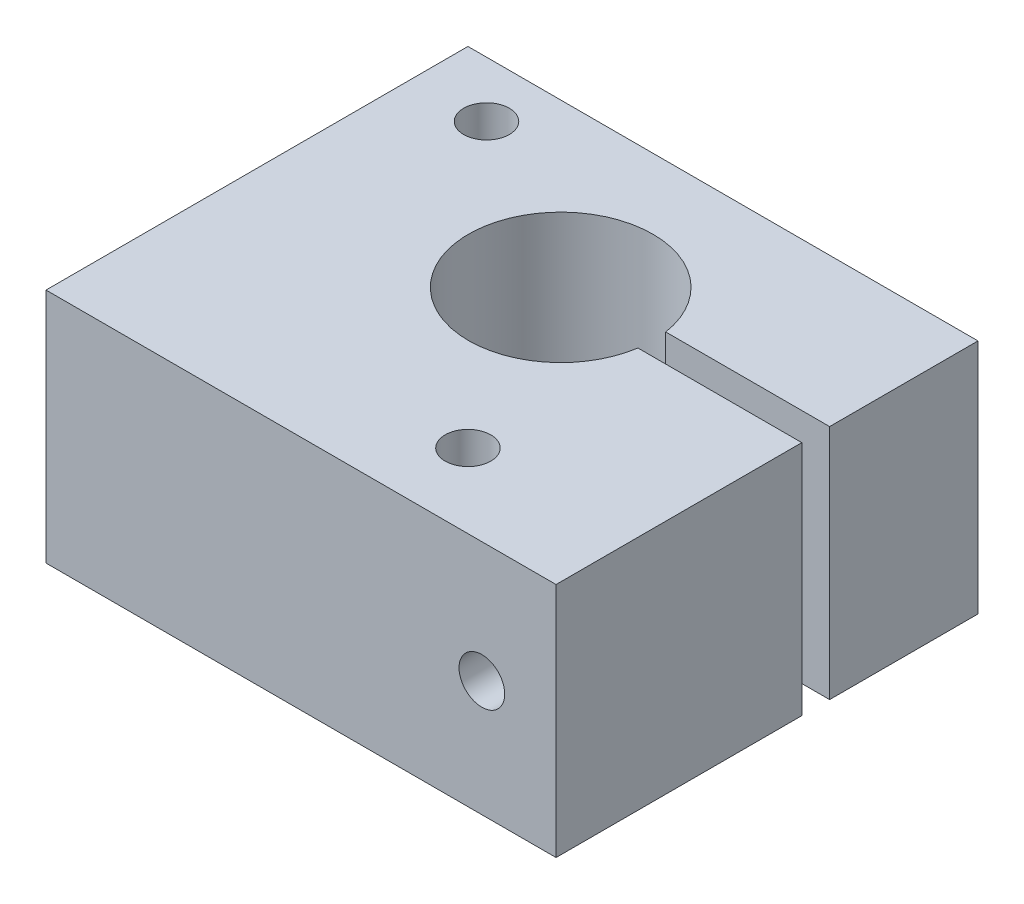
ISO-10303-21;
HEADER;
FILE_DESCRIPTION(('STEP AP214'),'2;1');
FILE_NAME('part.step','',(''),(''),'','','');
FILE_SCHEMA(('AUTOMOTIVE_DESIGN { 1 0 10303 214 1 1 1 1 }'));
ENDSEC;
DATA;
#1=APPLICATION_CONTEXT('core data for automotive mechanical design processes');
#2=APPLICATION_PROTOCOL_DEFINITION('international standard','automotive_design',2000,#1);
#3=PRODUCT_CONTEXT('',#1,'mechanical');
#4=PRODUCT('Part','Part','',(#3));
#5=PRODUCT_RELATED_PRODUCT_CATEGORY('part','',(#4));
#6=PRODUCT_DEFINITION_FORMATION('','',#4);
#7=PRODUCT_DEFINITION_CONTEXT('part definition',#1,'design');
#8=PRODUCT_DEFINITION('design','',#6,#7);
#9=PRODUCT_DEFINITION_SHAPE('','',#8);
#10=(LENGTH_UNIT() NAMED_UNIT(*) SI_UNIT(.MILLI.,.METRE.));
#11=(NAMED_UNIT(*) PLANE_ANGLE_UNIT() SI_UNIT($,.RADIAN.));
#12=(NAMED_UNIT(*) SI_UNIT($,.STERADIAN.) SOLID_ANGLE_UNIT());
#13=UNCERTAINTY_MEASURE_WITH_UNIT(LENGTH_MEASURE(1.E-05),#10,'distance_accuracy_value','');
#14=(GEOMETRIC_REPRESENTATION_CONTEXT(3) GLOBAL_UNCERTAINTY_ASSIGNED_CONTEXT((#13)) GLOBAL_UNIT_ASSIGNED_CONTEXT((#10,
#11,#12)) REPRESENTATION_CONTEXT('',''));
#15=CARTESIAN_POINT('',(0.,0.,0.));
#16=DIRECTION('',(0.,0.,1.));
#17=DIRECTION('',(1.,0.,0.));
#18=AXIS2_PLACEMENT_3D('',#15,#16,#17);
#19=CARTESIAN_POINT('',(13.97,12.954,11.557));
#20=DIRECTION('',(-1.,0.,0.));
#21=DIRECTION('',(0.,0.,1.));
#22=AXIS2_PLACEMENT_3D('',#19,#20,#21);
#23=PLANE('',#22);
#24=DIRECTION('',(0.,0.,-1.));
#25=VECTOR('',#24,1.);
#26=CARTESIAN_POINT('',(13.97,12.954,11.557));
#27=LINE('',#26,#25);
#28=CARTESIAN_POINT('',(13.97,12.954,-3.429));
#29=VERTEX_POINT('',#28);
#30=CARTESIAN_POINT('',(13.97,12.954,-11.557));
#31=VERTEX_POINT('',#30);
#32=EDGE_CURVE('E146',#29,#31,#27,.T.);
#33=ORIENTED_EDGE('',*,*,#32,.F.);
#34=DIRECTION('',(0.,1.,0.));
#35=VECTOR('',#34,1.);
#36=CARTESIAN_POINT('',(13.97,0.,-3.429));
#37=LINE('',#36,#35);
#38=CARTESIAN_POINT('',(13.97,0.,-3.429));
#39=VERTEX_POINT('',#38);
#40=EDGE_CURVE('E112',#39,#29,#37,.T.);
#41=ORIENTED_EDGE('',*,*,#40,.F.);
#42=DIRECTION('',(0.,0.,-1.));
#43=VECTOR('',#42,1.);
#44=CARTESIAN_POINT('',(13.97,0.,11.557));
#45=LINE('',#44,#43);
#46=CARTESIAN_POINT('',(13.97,0.,-11.557));
#47=VERTEX_POINT('',#46);
#48=EDGE_CURVE('E131',#39,#47,#45,.T.);
#49=ORIENTED_EDGE('',*,*,#48,.T.);
#50=DIRECTION('',(0.,-1.,0.));
#51=VECTOR('',#50,1.);
#52=CARTESIAN_POINT('',(13.97,12.954,-11.557));
#53=LINE('',#52,#51);
#54=EDGE_CURVE('E157',#31,#47,#53,.T.);
#55=ORIENTED_EDGE('',*,*,#54,.F.);
#56=EDGE_LOOP('',(#33,#41,#49,#55));
#57=FACE_BOUND('',#56,.T.);
#58=ADVANCED_FACE('F39',(#57),#23,.F.);
#59=CARTESIAN_POINT('',(13.97,0.,11.557));
#60=VERTEX_POINT('',#59);
#61=CARTESIAN_POINT('',(13.97,0.,-1.905));
#62=VERTEX_POINT('',#61);
#63=EDGE_CURVE('E121',#60,#62,#45,.T.);
#64=ORIENTED_EDGE('',*,*,#63,.T.);
#65=DIRECTION('',(0.,1.,0.));
#66=VECTOR('',#65,1.);
#67=CARTESIAN_POINT('',(13.97,0.,-1.905));
#68=LINE('',#67,#66);
#69=CARTESIAN_POINT('',(13.97,12.954,-1.905));
#70=VERTEX_POINT('',#69);
#71=EDGE_CURVE('E103',#62,#70,#68,.T.);
#72=ORIENTED_EDGE('',*,*,#71,.T.);
#73=CARTESIAN_POINT('',(13.97,12.954,11.557));
#74=VERTEX_POINT('',#73);
#75=EDGE_CURVE('E169',#74,#70,#27,.T.);
#76=ORIENTED_EDGE('',*,*,#75,.F.);
#77=DIRECTION('',(0.,-1.,0.));
#78=VECTOR('',#77,1.);
#79=CARTESIAN_POINT('',(13.97,12.954,11.557));
#80=LINE('',#79,#78);
#81=EDGE_CURVE('E128',#74,#60,#80,.T.);
#82=ORIENTED_EDGE('',*,*,#81,.T.);
#83=EDGE_LOOP('',(#64,#72,#76,#82));
#84=FACE_BOUND('',#83,.T.);
#85=ADVANCED_FACE('F41',(#84),#23,.F.);
#86=CARTESIAN_POINT('',(-13.97,12.954,-11.557));
#87=DIRECTION('',(0.,0.,1.));
#88=DIRECTION('',(1.,0.,0.));
#89=AXIS2_PLACEMENT_3D('',#86,#87,#88);
#90=PLANE('',#89);
#91=CARTESIAN_POINT('',(9.906,6.35,-11.557));
#92=DIRECTION('',(0.,0.,-1.));
#93=DIRECTION('',(-1.,0.,0.));
#94=AXIS2_PLACEMENT_3D('',#91,#92,#93);
#95=CIRCLE('',#94,3.048);
#96=CARTESIAN_POINT('',(6.858,6.35,-11.557));
#97=VERTEX_POINT('',#96);
#98=EDGE_CURVE('E380',#97,#97,#95,.T.);
#99=ORIENTED_EDGE('',*,*,#98,.F.);
#100=EDGE_LOOP('',(#99));
#101=FACE_BOUND('',#100,.T.);
#102=DIRECTION('',(-1.,0.,0.));
#103=VECTOR('',#102,1.);
#104=CARTESIAN_POINT('',(-13.97,0.,-11.557));
#105=LINE('',#104,#103);
#106=CARTESIAN_POINT('',(-13.97,0.,-11.557));
#107=VERTEX_POINT('',#106);
#108=EDGE_CURVE('E130',#47,#107,#105,.T.);
#109=ORIENTED_EDGE('',*,*,#108,.T.);
#110=DIRECTION('',(0.,-1.,0.));
#111=VECTOR('',#110,1.);
#112=CARTESIAN_POINT('',(-13.97,12.954,-11.557));
#113=LINE('',#112,#111);
#114=CARTESIAN_POINT('',(-13.97,12.954,-11.557));
#115=VERTEX_POINT('',#114);
#116=EDGE_CURVE('E153',#115,#107,#113,.T.);
#117=ORIENTED_EDGE('',*,*,#116,.F.);
#118=DIRECTION('',(-1.,0.,0.));
#119=VECTOR('',#118,1.);
#120=CARTESIAN_POINT('',(-13.97,12.954,-11.557));
#121=LINE('',#120,#119);
#122=EDGE_CURVE('E189',#31,#115,#121,.T.);
#123=ORIENTED_EDGE('',*,*,#122,.F.);
#124=ORIENTED_EDGE('',*,*,#54,.T.);
#125=EDGE_LOOP('',(#109,#117,#123,#124));
#126=FACE_BOUND('',#125,.T.);
#127=ADVANCED_FACE('F207',(#101,#126),#90,.F.);
#128=CARTESIAN_POINT('',(-13.97,12.954,11.557));
#129=DIRECTION('',(1.,0.,0.));
#130=DIRECTION('',(0.,0.,-1.));
#131=AXIS2_PLACEMENT_3D('',#128,#129,#130);
#132=PLANE('',#131);
#133=DIRECTION('',(0.,0.,1.));
#134=VECTOR('',#133,1.);
#135=CARTESIAN_POINT('',(-13.97,0.,11.557));
#136=LINE('',#135,#134);
#137=CARTESIAN_POINT('',(-13.97,0.,11.557));
#138=VERTEX_POINT('',#137);
#139=EDGE_CURVE('E135',#107,#138,#136,.T.);
#140=ORIENTED_EDGE('',*,*,#139,.T.);
#141=DIRECTION('',(0.,-1.,0.));
#142=VECTOR('',#141,1.);
#143=CARTESIAN_POINT('',(-13.97,12.954,11.557));
#144=LINE('',#143,#142);
#145=CARTESIAN_POINT('',(-13.97,12.954,11.557));
#146=VERTEX_POINT('',#145);
#147=EDGE_CURVE('E149',#146,#138,#144,.T.);
#148=ORIENTED_EDGE('',*,*,#147,.F.);
#149=DIRECTION('',(0.,0.,1.));
#150=VECTOR('',#149,1.);
#151=CARTESIAN_POINT('',(-13.97,12.954,11.557));
#152=LINE('',#151,#150);
#153=EDGE_CURVE('E191',#115,#146,#152,.T.);
#154=ORIENTED_EDGE('',*,*,#153,.F.);
#155=ORIENTED_EDGE('',*,*,#116,.T.);
#156=EDGE_LOOP('',(#140,#148,#154,#155));
#157=FACE_BOUND('',#156,.T.);
#158=ADVANCED_FACE('F203',(#157),#132,.F.);
#159=CARTESIAN_POINT('',(-13.97,12.954,11.557));
#160=DIRECTION('',(0.,0.,-1.));
#161=DIRECTION('',(-1.,0.,0.));
#162=AXIS2_PLACEMENT_3D('',#159,#160,#161);
#163=PLANE('',#162);
#164=CARTESIAN_POINT('',(9.906,6.35,11.557));
#165=DIRECTION('',(0.,0.,-1.));
#166=DIRECTION('',(-1.,0.,0.));
#167=AXIS2_PLACEMENT_3D('',#164,#165,#166);
#168=CIRCLE('',#167,1.25);
#169=CARTESIAN_POINT('',(8.656,6.35,11.557));
#170=VERTEX_POINT('',#169);
#171=EDGE_CURVE('E395',#170,#170,#168,.T.);
#172=ORIENTED_EDGE('',*,*,#171,.T.);
#173=EDGE_LOOP('',(#172));
#174=FACE_BOUND('',#173,.T.);
#175=DIRECTION('',(1.,0.,0.));
#176=VECTOR('',#175,1.);
#177=CARTESIAN_POINT('',(-13.97,0.,11.557));
#178=LINE('',#177,#176);
#179=EDGE_CURVE('E143',#138,#60,#178,.T.);
#180=ORIENTED_EDGE('',*,*,#179,.T.);
#181=ORIENTED_EDGE('',*,*,#81,.F.);
#182=DIRECTION('',(1.,0.,0.));
#183=VECTOR('',#182,1.);
#184=CARTESIAN_POINT('',(-13.97,12.954,11.557));
#185=LINE('',#184,#183);
#186=EDGE_CURVE('E138',#146,#74,#185,.T.);
#187=ORIENTED_EDGE('',*,*,#186,.F.);
#188=ORIENTED_EDGE('',*,*,#147,.T.);
#189=EDGE_LOOP('',(#180,#181,#187,#188));
#190=FACE_BOUND('',#189,.T.);
#191=ADVANCED_FACE('F198',(#174,#190),#163,.F.);
#192=CARTESIAN_POINT('',(0.,12.954,0.));
#193=DIRECTION('',(0.,-1.,0.));
#194=DIRECTION('',(0.,0.,-1.));
#195=AXIS2_PLACEMENT_3D('',#192,#193,#194);
#196=PLANE('',#195);
#197=CARTESIAN_POINT('',(-9.906,12.954,-8.509));
#198=DIRECTION('',(0.,1.,0.));
#199=DIRECTION('',(0.,0.,1.));
#200=AXIS2_PLACEMENT_3D('',#197,#198,#199);
#201=CIRCLE('',#200,1.25);
#202=CARTESIAN_POINT('',(-9.906,12.954,-7.259));
#203=VERTEX_POINT('',#202);
#204=EDGE_CURVE('E177',#203,#203,#201,.T.);
#205=ORIENTED_EDGE('',*,*,#204,.F.);
#206=EDGE_LOOP('',(#205));
#207=FACE_BOUND('',#206,.T.);
#208=CARTESIAN_POINT('',(5.08,12.954,7.493));
#209=DIRECTION('',(0.,1.,0.));
#210=DIRECTION('',(0.,0.,1.));
#211=AXIS2_PLACEMENT_3D('',#208,#209,#210);
#212=CIRCLE('',#211,1.25);
#213=CARTESIAN_POINT('',(5.08,12.954,8.743));
#214=VERTEX_POINT('',#213);
#215=EDGE_CURVE('E369',#214,#214,#212,.T.);
#216=ORIENTED_EDGE('',*,*,#215,.F.);
#217=EDGE_LOOP('',(#216));
#218=FACE_BOUND('',#217,.T.);
#219=CARTESIAN_POINT('',(0.,12.954,-2.667));
#220=DIRECTION('',(0.,1.,0.));
#221=DIRECTION('',(0.,0.,1.));
#222=AXIS2_PLACEMENT_3D('',#219,#220,#221);
#223=CIRCLE('',#222,5.05);
#224=CARTESIAN_POINT('',(4.99217948395288,12.954,-3.429));
#225=VERTEX_POINT('',#224);
#226=CARTESIAN_POINT('',(4.99217948395288,12.954,-1.905));
#227=VERTEX_POINT('',#226);
#228=EDGE_CURVE('E166',#225,#227,#223,.T.);
#229=ORIENTED_EDGE('',*,*,#228,.F.);
#230=DIRECTION('',(-1.,0.,0.));
#231=VECTOR('',#230,1.);
#232=CARTESIAN_POINT('',(0.,12.954,-3.429));
#233=LINE('',#232,#231);
#234=EDGE_CURVE('E56',#29,#225,#233,.T.);
#235=ORIENTED_EDGE('',*,*,#234,.F.);
#236=ORIENTED_EDGE('',*,*,#32,.T.);
#237=ORIENTED_EDGE('',*,*,#122,.T.);
#238=ORIENTED_EDGE('',*,*,#153,.T.);
#239=ORIENTED_EDGE('',*,*,#186,.T.);
#240=ORIENTED_EDGE('',*,*,#75,.T.);
#241=DIRECTION('',(1.,0.,0.));
#242=VECTOR('',#241,1.);
#243=CARTESIAN_POINT('',(0.,12.954,-1.905));
#244=LINE('',#243,#242);
#245=EDGE_CURVE('E106',#227,#70,#244,.T.);
#246=ORIENTED_EDGE('',*,*,#245,.F.);
#247=EDGE_LOOP('',(#229,#235,#236,#237,#238,#239,#240,#246));
#248=FACE_BOUND('',#247,.T.);
#249=ADVANCED_FACE('F168',(#207,#218,#248),#196,.F.);
#250=CARTESIAN_POINT('',(0.,0.,0.));
#251=DIRECTION('',(0.,-1.,0.));
#252=DIRECTION('',(0.,0.,-1.));
#253=AXIS2_PLACEMENT_3D('',#250,#251,#252);
#254=PLANE('',#253);
#255=CARTESIAN_POINT('',(-9.906,0.,-8.509));
#256=DIRECTION('',(0.,1.,0.));
#257=DIRECTION('',(0.,0.,1.));
#258=AXIS2_PLACEMENT_3D('',#255,#256,#257);
#259=CIRCLE('',#258,1.25);
#260=CARTESIAN_POINT('',(-9.906,0.,-7.259));
#261=VERTEX_POINT('',#260);
#262=EDGE_CURVE('E171',#261,#261,#259,.T.);
#263=ORIENTED_EDGE('',*,*,#262,.T.);
#264=EDGE_LOOP('',(#263));
#265=FACE_BOUND('',#264,.T.);
#266=CARTESIAN_POINT('',(5.08,0.,7.493));
#267=DIRECTION('',(0.,1.,0.));
#268=DIRECTION('',(0.,0.,1.));
#269=AXIS2_PLACEMENT_3D('',#266,#267,#268);
#270=CIRCLE('',#269,1.25);
#271=CARTESIAN_POINT('',(5.08,0.,8.743));
#272=VERTEX_POINT('',#271);
#273=EDGE_CURVE('E365',#272,#272,#270,.T.);
#274=ORIENTED_EDGE('',*,*,#273,.T.);
#275=EDGE_LOOP('',(#274));
#276=FACE_BOUND('',#275,.T.);
#277=DIRECTION('',(-1.,0.,0.));
#278=VECTOR('',#277,1.);
#279=CARTESIAN_POINT('',(0.,0.,-3.429));
#280=LINE('',#279,#278);
#281=CARTESIAN_POINT('',(4.99217948395288,0.,-3.429));
#282=VERTEX_POINT('',#281);
#283=EDGE_CURVE('E113',#39,#282,#280,.T.);
#284=ORIENTED_EDGE('',*,*,#283,.T.);
#285=CARTESIAN_POINT('',(0.,0.,-2.667));
#286=DIRECTION('',(0.,1.,0.));
#287=DIRECTION('',(0.,0.,1.));
#288=AXIS2_PLACEMENT_3D('',#285,#286,#287);
#289=CIRCLE('',#288,5.05);
#290=CARTESIAN_POINT('',(4.99217948395288,0.,-1.905));
#291=VERTEX_POINT('',#290);
#292=EDGE_CURVE('E123',#282,#291,#289,.T.);
#293=ORIENTED_EDGE('',*,*,#292,.T.);
#294=DIRECTION('',(1.,0.,0.));
#295=VECTOR('',#294,1.);
#296=CARTESIAN_POINT('',(0.,0.,-1.905));
#297=LINE('',#296,#295);
#298=EDGE_CURVE('E63',#291,#62,#297,.T.);
#299=ORIENTED_EDGE('',*,*,#298,.T.);
#300=ORIENTED_EDGE('',*,*,#63,.F.);
#301=ORIENTED_EDGE('',*,*,#179,.F.);
#302=ORIENTED_EDGE('',*,*,#139,.F.);
#303=ORIENTED_EDGE('',*,*,#108,.F.);
#304=ORIENTED_EDGE('',*,*,#48,.F.);
#305=EDGE_LOOP('',(#284,#293,#299,#300,#301,#302,#303,#304));
#306=FACE_BOUND('',#305,.T.);
#307=ADVANCED_FACE('F119',(#265,#276,#306),#254,.T.);
#308=CARTESIAN_POINT('',(0.,0.,-2.667));
#309=DIRECTION('',(0.,1.,0.));
#310=DIRECTION('',(0.,0.,1.));
#311=AXIS2_PLACEMENT_3D('',#308,#309,#310);
#312=CYLINDRICAL_SURFACE('',#311,5.05);
#313=ORIENTED_EDGE('',*,*,#292,.F.);
#314=DIRECTION('',(0.,1.,0.));
#315=VECTOR('',#314,1.);
#316=CARTESIAN_POINT('',(4.99217948395288,0.,-3.429));
#317=LINE('',#316,#315);
#318=EDGE_CURVE('E11',#282,#225,#317,.T.);
#319=ORIENTED_EDGE('',*,*,#318,.T.);
#320=ORIENTED_EDGE('',*,*,#228,.T.);
#321=DIRECTION('',(0.,1.,0.));
#322=VECTOR('',#321,1.);
#323=CARTESIAN_POINT('',(4.99217948395288,0.,-1.905));
#324=LINE('',#323,#322);
#325=EDGE_CURVE('E49',#227,#291,#324,.F.);
#326=ORIENTED_EDGE('',*,*,#325,.T.);
#327=EDGE_LOOP('',(#313,#319,#320,#326));
#328=FACE_BOUND('',#327,.T.);
#329=ADVANCED_FACE('F164',(#328),#312,.F.);
#330=CARTESIAN_POINT('',(0.,0.,-1.905));
#331=DIRECTION('',(0.,0.,1.));
#332=DIRECTION('',(1.,0.,0.));
#333=AXIS2_PLACEMENT_3D('',#330,#331,#332);
#334=PLANE('',#333);
#335=CARTESIAN_POINT('',(9.906,6.35,-1.905));
#336=DIRECTION('',(0.,0.,1.));
#337=DIRECTION('',(1.,0.,0.));
#338=AXIS2_PLACEMENT_3D('',#335,#336,#337);
#339=CIRCLE('',#338,1.25);
#340=CARTESIAN_POINT('',(11.156,6.35,-1.905));
#341=VERTEX_POINT('',#340);
#342=EDGE_CURVE('E43',#341,#341,#339,.T.);
#343=ORIENTED_EDGE('',*,*,#342,.T.);
#344=EDGE_LOOP('',(#343));
#345=FACE_BOUND('',#344,.T.);
#346=ORIENTED_EDGE('',*,*,#245,.T.);
#347=ORIENTED_EDGE('',*,*,#71,.F.);
#348=ORIENTED_EDGE('',*,*,#298,.F.);
#349=ORIENTED_EDGE('',*,*,#325,.F.);
#350=EDGE_LOOP('',(#346,#347,#348,#349));
#351=FACE_BOUND('',#350,.T.);
#352=ADVANCED_FACE('F104',(#345,#351),#334,.F.);
#353=CARTESIAN_POINT('',(0.,0.,-3.429));
#354=DIRECTION('',(0.,0.,-1.));
#355=DIRECTION('',(-1.,0.,0.));
#356=AXIS2_PLACEMENT_3D('',#353,#354,#355);
#357=PLANE('',#356);
#358=CARTESIAN_POINT('',(9.906,6.35,-3.429));
#359=DIRECTION('',(0.,0.,-1.));
#360=DIRECTION('',(-1.,0.,0.));
#361=AXIS2_PLACEMENT_3D('',#358,#359,#360);
#362=CIRCLE('',#361,1.7);
#363=CARTESIAN_POINT('',(8.206,6.35,-3.429));
#364=VERTEX_POINT('',#363);
#365=EDGE_CURVE('E391',#364,#364,#362,.F.);
#366=ORIENTED_EDGE('',*,*,#365,.F.);
#367=EDGE_LOOP('',(#366));
#368=FACE_BOUND('',#367,.T.);
#369=ORIENTED_EDGE('',*,*,#283,.F.);
#370=ORIENTED_EDGE('',*,*,#40,.T.);
#371=ORIENTED_EDGE('',*,*,#234,.T.);
#372=ORIENTED_EDGE('',*,*,#318,.F.);
#373=EDGE_LOOP('',(#369,#370,#371,#372));
#374=FACE_BOUND('',#373,.T.);
#375=ADVANCED_FACE('F213',(#368,#374),#357,.F.);
#376=CARTESIAN_POINT('',(5.08,0.,7.493));
#377=DIRECTION('',(0.,1.,0.));
#378=DIRECTION('',(0.,0.,1.));
#379=AXIS2_PLACEMENT_3D('',#376,#377,#378);
#380=CYLINDRICAL_SURFACE('',#379,1.25);
#381=ORIENTED_EDGE('',*,*,#273,.F.);
#382=EDGE_LOOP('',(#381));
#383=FACE_BOUND('',#382,.T.);
#384=ORIENTED_EDGE('',*,*,#215,.T.);
#385=EDGE_LOOP('',(#384));
#386=FACE_BOUND('',#385,.T.);
#387=ADVANCED_FACE('F216',(#383,#386),#380,.F.);
#388=CARTESIAN_POINT('',(-9.906,0.,-8.509));
#389=DIRECTION('',(0.,1.,0.));
#390=DIRECTION('',(0.,0.,1.));
#391=AXIS2_PLACEMENT_3D('',#388,#389,#390);
#392=CYLINDRICAL_SURFACE('',#391,1.25);
#393=ORIENTED_EDGE('',*,*,#262,.F.);
#394=EDGE_LOOP('',(#393));
#395=FACE_BOUND('',#394,.T.);
#396=ORIENTED_EDGE('',*,*,#204,.T.);
#397=EDGE_LOOP('',(#396));
#398=FACE_BOUND('',#397,.T.);
#399=ADVANCED_FACE('F223',(#395,#398),#392,.F.);
#400=CARTESIAN_POINT('',(9.906,6.35,-7.239));
#401=DIRECTION('',(0.,0.,-1.));
#402=DIRECTION('',(-1.,0.,0.));
#403=AXIS2_PLACEMENT_3D('',#400,#401,#402);
#404=CYLINDRICAL_SURFACE('',#403,3.048);
#405=CARTESIAN_POINT('',(9.906,6.35,-7.239));
#406=DIRECTION('',(0.,0.,-1.));
#407=DIRECTION('',(-1.,0.,0.));
#408=AXIS2_PLACEMENT_3D('',#405,#406,#407);
#409=CIRCLE('',#408,3.048);
#410=CARTESIAN_POINT('',(6.858,6.35,-7.239));
#411=VERTEX_POINT('',#410);
#412=EDGE_CURVE('E375',#411,#411,#409,.T.);
#413=ORIENTED_EDGE('',*,*,#412,.F.);
#414=EDGE_LOOP('',(#413));
#415=FACE_BOUND('',#414,.T.);
#416=ORIENTED_EDGE('',*,*,#98,.T.);
#417=EDGE_LOOP('',(#416));
#418=FACE_BOUND('',#417,.T.);
#419=ADVANCED_FACE('F294',(#415,#418),#404,.F.);
#420=CARTESIAN_POINT('',(9.906,6.35,-7.239));
#421=DIRECTION('',(0.,0.,-1.));
#422=DIRECTION('',(-1.,0.,0.));
#423=AXIS2_PLACEMENT_3D('',#420,#421,#422);
#424=PLANE('',#423);
#425=CARTESIAN_POINT('',(9.906,6.35,-7.239));
#426=DIRECTION('',(0.,0.,-1.));
#427=DIRECTION('',(-1.,0.,0.));
#428=AXIS2_PLACEMENT_3D('',#425,#426,#427);
#429=CIRCLE('',#428,1.7);
#430=CARTESIAN_POINT('',(8.206,6.35,-7.239));
#431=VERTEX_POINT('',#430);
#432=EDGE_CURVE('E386',#431,#431,#429,.T.);
#433=ORIENTED_EDGE('',*,*,#432,.F.);
#434=EDGE_LOOP('',(#433));
#435=FACE_BOUND('',#434,.T.);
#436=ORIENTED_EDGE('',*,*,#412,.T.);
#437=EDGE_LOOP('',(#436));
#438=FACE_BOUND('',#437,.T.);
#439=ADVANCED_FACE('F287',(#435,#438),#424,.T.);
#440=CARTESIAN_POINT('',(9.906,6.35,11.558));
#441=DIRECTION('',(0.,0.,-1.));
#442=DIRECTION('',(-1.,0.,0.));
#443=AXIS2_PLACEMENT_3D('',#440,#441,#442);
#444=CYLINDRICAL_SURFACE('',#443,1.7);
#445=ORIENTED_EDGE('',*,*,#432,.T.);
#446=EDGE_LOOP('',(#445));
#447=FACE_BOUND('',#446,.T.);
#448=ORIENTED_EDGE('',*,*,#365,.T.);
#449=EDGE_LOOP('',(#448));
#450=FACE_BOUND('',#449,.T.);
#451=ADVANCED_FACE('F277',(#447,#450),#444,.F.);
#452=CARTESIAN_POINT('',(9.906,6.35,11.557));
#453=DIRECTION('',(0.,0.,-1.));
#454=DIRECTION('',(-1.,0.,0.));
#455=AXIS2_PLACEMENT_3D('',#452,#453,#454);
#456=CYLINDRICAL_SURFACE('',#455,1.25);
#457=ORIENTED_EDGE('',*,*,#171,.F.);
#458=EDGE_LOOP('',(#457));
#459=FACE_BOUND('',#458,.T.);
#460=ORIENTED_EDGE('',*,*,#342,.F.);
#461=EDGE_LOOP('',(#460));
#462=FACE_BOUND('',#461,.T.);
#463=ADVANCED_FACE('F273',(#459,#462),#456,.F.);
#464=CLOSED_SHELL('',(#58,#85,#127,#158,#191,#249,#307,#329,#352,#375,#387,#399,#419,#439,#451,#463));
#465=MANIFOLD_SOLID_BREP('B2',#464);
#466=ADVANCED_BREP_SHAPE_REPRESENTATION('',(#18,#465),#14);
#467=SHAPE_DEFINITION_REPRESENTATION(#9,#466);
ENDSEC;
END-ISO-10303-21;
